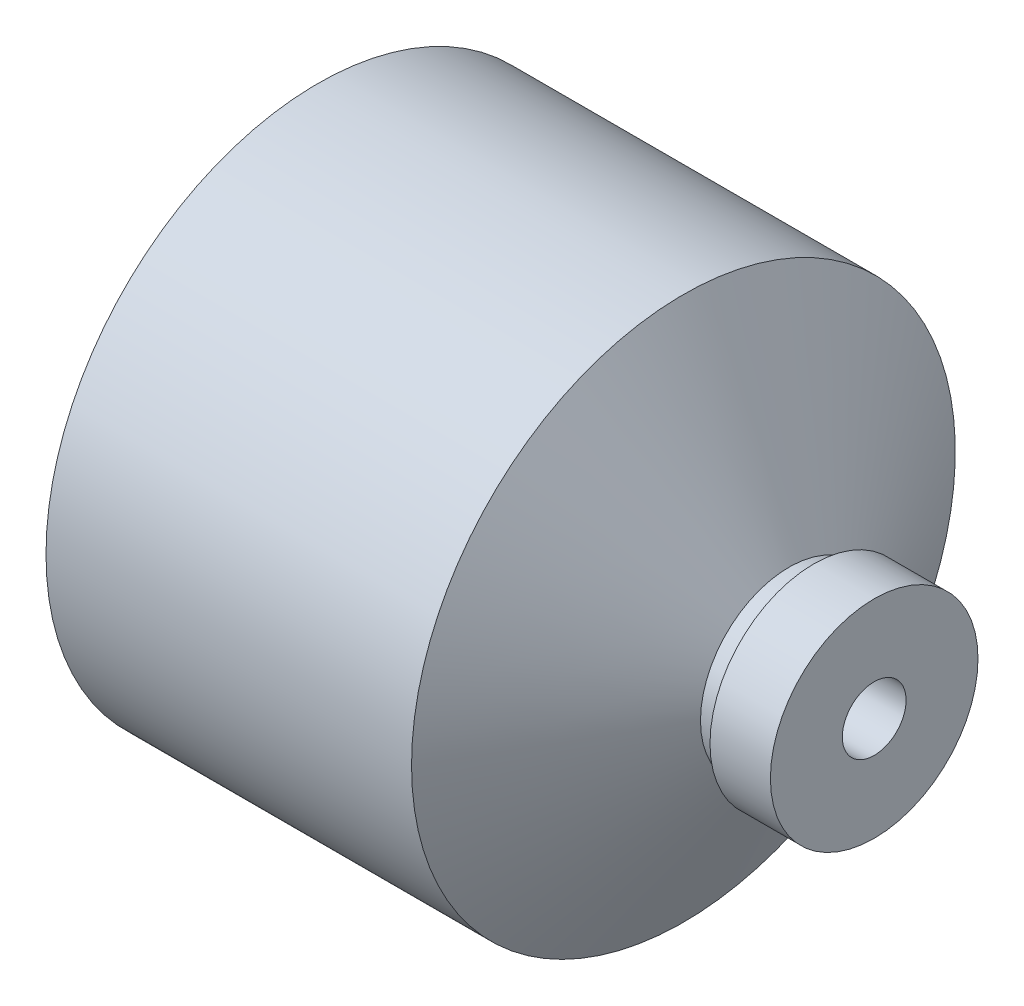
ISO-10303-21;
HEADER;
FILE_DESCRIPTION(('STEP AP214'),'2;1');
FILE_NAME('part.step','',(''),(''),'','','');
FILE_SCHEMA(('AUTOMOTIVE_DESIGN { 1 0 10303 214 1 1 1 1 }'));
ENDSEC;
DATA;
#1=APPLICATION_CONTEXT('core data for automotive mechanical design processes');
#2=APPLICATION_PROTOCOL_DEFINITION('international standard','automotive_design',2000,#1);
#3=PRODUCT_CONTEXT('',#1,'mechanical');
#4=PRODUCT('Part','Part','',(#3));
#5=PRODUCT_RELATED_PRODUCT_CATEGORY('part','',(#4));
#6=PRODUCT_DEFINITION_FORMATION('','',#4);
#7=PRODUCT_DEFINITION_CONTEXT('part definition',#1,'design');
#8=PRODUCT_DEFINITION('design','',#6,#7);
#9=PRODUCT_DEFINITION_SHAPE('','',#8);
#10=(LENGTH_UNIT() NAMED_UNIT(*) SI_UNIT(.MILLI.,.METRE.));
#11=(NAMED_UNIT(*) PLANE_ANGLE_UNIT() SI_UNIT($,.RADIAN.));
#12=(NAMED_UNIT(*) SI_UNIT($,.STERADIAN.) SOLID_ANGLE_UNIT());
#13=UNCERTAINTY_MEASURE_WITH_UNIT(LENGTH_MEASURE(1.E-05),#10,'distance_accuracy_value','');
#14=(GEOMETRIC_REPRESENTATION_CONTEXT(3) GLOBAL_UNCERTAINTY_ASSIGNED_CONTEXT((#13)) GLOBAL_UNIT_ASSIGNED_CONTEXT((#10,
#11,#12)) REPRESENTATION_CONTEXT('',''));
#15=CARTESIAN_POINT('',(0.,0.,0.));
#16=DIRECTION('',(0.,0.,1.));
#17=DIRECTION('',(1.,0.,0.));
#18=AXIS2_PLACEMENT_3D('',#15,#16,#17);
#19=CARTESIAN_POINT('',(-73.6619546181365,0.,-36.));
#20=DIRECTION('',(1.,0.,0.));
#21=DIRECTION('',(0.,0.,-1.));
#22=AXIS2_PLACEMENT_3D('',#19,#20,#21);
#23=PLANE('',#22);
#24=CARTESIAN_POINT('',(-73.6619546181365,0.,0.));
#25=DIRECTION('',(-1.,0.,0.));
#26=DIRECTION('',(0.,0.,1.));
#27=AXIS2_PLACEMENT_3D('',#24,#25,#26);
#28=CIRCLE('',#27,33.75);
#29=CARTESIAN_POINT('',(-73.6619546181365,0.,33.75));
#30=VERTEX_POINT('',#29);
#31=EDGE_CURVE('E10',#30,#30,#28,.T.);
#32=ORIENTED_EDGE('',*,*,#31,.F.);
#33=EDGE_LOOP('',(#32));
#34=FACE_BOUND('',#33,.T.);
#35=CARTESIAN_POINT('',(-73.6619546181365,0.,0.));
#36=DIRECTION('',(-1.,0.,0.));
#37=DIRECTION('',(0.,0.,1.));
#38=AXIS2_PLACEMENT_3D('',#35,#36,#37);
#39=CIRCLE('',#38,36.);
#40=CARTESIAN_POINT('',(-73.6619546181365,0.,36.));
#41=VERTEX_POINT('',#40);
#42=EDGE_CURVE('E88',#41,#41,#39,.T.);
#43=ORIENTED_EDGE('',*,*,#42,.T.);
#44=EDGE_LOOP('',(#43));
#45=FACE_BOUND('',#44,.T.);
#46=ADVANCED_FACE('F39',(#34,#45),#23,.F.);
#47=CARTESIAN_POINT('',(-73.6619546181365,0.,0.));
#48=DIRECTION('',(-1.,0.,0.));
#49=DIRECTION('',(0.,0.,1.));
#50=AXIS2_PLACEMENT_3D('',#47,#48,#49);
#51=CYLINDRICAL_SURFACE('',#50,33.75);
#52=CARTESIAN_POINT('',(-32.6619546181365,0.,0.));
#53=DIRECTION('',(-1.,0.,0.));
#54=DIRECTION('',(0.,0.,1.));
#55=AXIS2_PLACEMENT_3D('',#52,#53,#54);
#56=CIRCLE('',#55,33.75);
#57=CARTESIAN_POINT('',(-32.6619546181365,0.,33.75));
#58=VERTEX_POINT('',#57);
#59=EDGE_CURVE('E45',#58,#58,#56,.T.);
#60=ORIENTED_EDGE('',*,*,#59,.F.);
#61=EDGE_LOOP('',(#60));
#62=FACE_BOUND('',#61,.T.);
#63=ORIENTED_EDGE('',*,*,#31,.T.);
#64=EDGE_LOOP('',(#63));
#65=FACE_BOUND('',#64,.T.);
#66=ADVANCED_FACE('F167',(#62,#65),#51,.F.);
#67=CARTESIAN_POINT('',(-32.6619546181365,0.,0.));
#68=DIRECTION('',(-1.,0.,0.));
#69=DIRECTION('',(0.,0.,1.));
#70=AXIS2_PLACEMENT_3D('',#67,#68,#69);
#71=CONICAL_SURFACE('',#70,33.75,0.78539816339745);
#72=CARTESIAN_POINT('',(-23.6619546181365,0.,0.));
#73=DIRECTION('',(-1.,0.,0.));
#74=DIRECTION('',(0.,0.,1.));
#75=AXIS2_PLACEMENT_3D('',#72,#73,#74);
#76=CIRCLE('',#75,24.75);
#77=CARTESIAN_POINT('',(-23.6619546181365,0.,24.75));
#78=VERTEX_POINT('',#77);
#79=EDGE_CURVE('E49',#78,#78,#76,.T.);
#80=ORIENTED_EDGE('',*,*,#79,.F.);
#81=EDGE_LOOP('',(#80));
#82=FACE_BOUND('',#81,.T.);
#83=ORIENTED_EDGE('',*,*,#59,.T.);
#84=EDGE_LOOP('',(#83));
#85=FACE_BOUND('',#84,.T.);
#86=ADVANCED_FACE('F162',(#82,#85),#71,.F.);
#87=CARTESIAN_POINT('',(-23.6619546181365,0.,-24.75));
#88=DIRECTION('',(1.,0.,0.));
#89=DIRECTION('',(0.,0.,-1.));
#90=AXIS2_PLACEMENT_3D('',#87,#88,#89);
#91=PLANE('',#90);
#92=CARTESIAN_POINT('',(-23.6619546181365,0.,0.));
#93=DIRECTION('',(-1.,0.,0.));
#94=DIRECTION('',(0.,0.,1.));
#95=AXIS2_PLACEMENT_3D('',#92,#93,#94);
#96=CIRCLE('',#95,1.6);
#97=CARTESIAN_POINT('',(-23.6619546181365,0.,1.6));
#98=VERTEX_POINT('',#97);
#99=EDGE_CURVE('E53',#98,#98,#96,.T.);
#100=ORIENTED_EDGE('',*,*,#99,.F.);
#101=EDGE_LOOP('',(#100));
#102=FACE_BOUND('',#101,.T.);
#103=ORIENTED_EDGE('',*,*,#79,.T.);
#104=EDGE_LOOP('',(#103));
#105=FACE_BOUND('',#104,.T.);
#106=ADVANCED_FACE('F156',(#102,#105),#91,.F.);
#107=CARTESIAN_POINT('',(-73.6619546181365,0.,0.));
#108=DIRECTION('',(-1.,0.,0.));
#109=DIRECTION('',(0.,0.,1.));
#110=AXIS2_PLACEMENT_3D('',#107,#108,#109);
#111=CYLINDRICAL_SURFACE('',#110,1.6);
#112=CARTESIAN_POINT('',(-13.6619546181365,0.,0.));
#113=DIRECTION('',(-1.,0.,0.));
#114=DIRECTION('',(0.,0.,1.));
#115=AXIS2_PLACEMENT_3D('',#112,#113,#114);
#116=CIRCLE('',#115,1.6);
#117=CARTESIAN_POINT('',(-13.6619546181365,0.,1.6));
#118=VERTEX_POINT('',#117);
#119=EDGE_CURVE('E58',#118,#118,#116,.T.);
#120=ORIENTED_EDGE('',*,*,#119,.F.);
#121=EDGE_LOOP('',(#120));
#122=FACE_BOUND('',#121,.T.);
#123=ORIENTED_EDGE('',*,*,#99,.T.);
#124=EDGE_LOOP('',(#123));
#125=FACE_BOUND('',#124,.T.);
#126=ADVANCED_FACE('F150',(#122,#125),#111,.F.);
#127=CARTESIAN_POINT('',(-13.6619546181365,0.,-1.6));
#128=DIRECTION('',(1.,0.,0.));
#129=DIRECTION('',(0.,0.,-1.));
#130=AXIS2_PLACEMENT_3D('',#127,#128,#129);
#131=PLANE('',#130);
#132=CARTESIAN_POINT('',(-13.6619546181365,0.,0.));
#133=DIRECTION('',(-1.,0.,0.));
#134=DIRECTION('',(0.,0.,1.));
#135=AXIS2_PLACEMENT_3D('',#132,#133,#134);
#136=CIRCLE('',#135,1.);
#137=CARTESIAN_POINT('',(-13.6619546181365,0.,1.));
#138=VERTEX_POINT('',#137);
#139=EDGE_CURVE('E61',#138,#138,#136,.T.);
#140=ORIENTED_EDGE('',*,*,#139,.F.);
#141=EDGE_LOOP('',(#140));
#142=FACE_BOUND('',#141,.T.);
#143=ORIENTED_EDGE('',*,*,#119,.T.);
#144=EDGE_LOOP('',(#143));
#145=FACE_BOUND('',#144,.T.);
#146=ADVANCED_FACE('F144',(#142,#145),#131,.F.);
#147=CARTESIAN_POINT('',(-73.6619546181365,0.,0.));
#148=DIRECTION('',(-1.,0.,0.));
#149=DIRECTION('',(0.,0.,1.));
#150=AXIS2_PLACEMENT_3D('',#147,#148,#149);
#151=CYLINDRICAL_SURFACE('',#150,1.);
#152=CARTESIAN_POINT('',(-11.6619546181365,0.,0.));
#153=DIRECTION('',(-1.,0.,0.));
#154=DIRECTION('',(0.,0.,1.));
#155=AXIS2_PLACEMENT_3D('',#152,#153,#154);
#156=CIRCLE('',#155,1.);
#157=CARTESIAN_POINT('',(-11.6619546181365,0.,-0.999999999999999));
#158=VERTEX_POINT('',#157);
#159=EDGE_CURVE('E64',#158,#158,#156,.T.);
#160=ORIENTED_EDGE('',*,*,#159,.F.);
#161=EDGE_LOOP('',(#160));
#162=FACE_BOUND('',#161,.T.);
#163=ORIENTED_EDGE('',*,*,#139,.T.);
#164=EDGE_LOOP('',(#163));
#165=FACE_BOUND('',#164,.T.);
#166=ADVANCED_FACE('F138',(#162,#165),#151,.F.);
#167=CARTESIAN_POINT('',(-11.6619546181365,0.,0.));
#168=DIRECTION('',(1.,0.,0.));
#169=DIRECTION('',(0.,0.,-1.));
#170=AXIS2_PLACEMENT_3D('',#167,#168,#169);
#171=CONICAL_SURFACE('',#170,1.,1.0471975511966);
#172=CARTESIAN_POINT('',(-9.8,0.,0.));
#173=DIRECTION('',(-1.,0.,0.));
#174=DIRECTION('',(0.,0.,1.));
#175=AXIS2_PLACEMENT_3D('',#172,#173,#174);
#176=CIRCLE('',#175,4.225);
#177=CARTESIAN_POINT('',(-9.8,0.,-4.225));
#178=VERTEX_POINT('',#177);
#179=EDGE_CURVE('E67',#178,#178,#176,.T.);
#180=CARTESIAN_POINT('',(-9.8,0.,-4.225));
#181=CARTESIAN_POINT('',(-9.81939536060559,0.,-4.19140625));
#182=CARTESIAN_POINT('',(-9.83879072121118,0.,-4.1578125));
#183=CARTESIAN_POINT('',(-9.87758144242236,0.,-4.090625));
#184=CARTESIAN_POINT('',(-9.89697680302795,0.,-4.05703125));
#185=CARTESIAN_POINT('',(-9.93576752423913,0.,-3.98984375));
#186=CARTESIAN_POINT('',(-9.95516288484471,0.,-3.95625));
#187=CARTESIAN_POINT('',(-9.99395360605589,0.,-3.8890625));
#188=CARTESIAN_POINT('',(-10.0133489666615,0.,-3.85546875));
#189=CARTESIAN_POINT('',(-10.0521396878727,0.,-3.78828125));
#190=CARTESIAN_POINT('',(-10.0715350484782,0.,-3.7546875));
#191=CARTESIAN_POINT('',(-10.1103257696894,0.,-3.6875));
#192=CARTESIAN_POINT('',(-10.129721130295,0.,-3.65390625));
#193=CARTESIAN_POINT('',(-10.1685118515062,0.,-3.58671875));
#194=CARTESIAN_POINT('',(-10.1879072121118,0.,-3.553125));
#195=CARTESIAN_POINT('',(-10.226697933323,0.,-3.4859375));
#196=CARTESIAN_POINT('',(-10.2460932939285,0.,-3.45234375));
#197=CARTESIAN_POINT('',(-10.2848840151397,0.,-3.38515625));
#198=CARTESIAN_POINT('',(-10.3042793757453,0.,-3.3515625));
#199=CARTESIAN_POINT('',(-10.3430700969565,0.,-3.284375));
#200=CARTESIAN_POINT('',(-10.3624654575621,0.,-3.25078125));
#201=CARTESIAN_POINT('',(-10.4012561787733,0.,-3.18359375));
#202=CARTESIAN_POINT('',(-10.4206515393788,0.,-3.15));
#203=CARTESIAN_POINT('',(-10.45944226059,0.,-3.0828125));
#204=CARTESIAN_POINT('',(-10.4788376211956,0.,-3.04921875));
#205=CARTESIAN_POINT('',(-10.5176283424068,0.,-2.98203125));
#206=CARTESIAN_POINT('',(-10.5370237030124,0.,-2.9484375));
#207=CARTESIAN_POINT('',(-10.5758144242236,0.,-2.88125));
#208=CARTESIAN_POINT('',(-10.5952097848291,0.,-2.84765625));
#209=CARTESIAN_POINT('',(-10.6340005060403,0.,-2.78046875));
#210=CARTESIAN_POINT('',(-10.6533958666459,0.,-2.746875));
#211=CARTESIAN_POINT('',(-10.6921865878571,0.,-2.6796875));
#212=CARTESIAN_POINT('',(-10.7115819484627,0.,-2.64609375));
#213=CARTESIAN_POINT('',(-10.7503726696738,0.,-2.57890625));
#214=CARTESIAN_POINT('',(-10.7697680302794,0.,-2.5453125));
#215=CARTESIAN_POINT('',(-10.8085587514906,0.,-2.478125));
#216=CARTESIAN_POINT('',(-10.8279541120962,0.,-2.44453125));
#217=CARTESIAN_POINT('',(-10.8667448333074,0.,-2.37734375));
#218=CARTESIAN_POINT('',(-10.886140193913,0.,-2.34375));
#219=CARTESIAN_POINT('',(-10.9249309151241,0.,-2.2765625));
#220=CARTESIAN_POINT('',(-10.9443262757297,0.,-2.24296875));
#221=CARTESIAN_POINT('',(-10.9831169969409,0.,-2.17578125));
#222=CARTESIAN_POINT('',(-11.0025123575465,0.,-2.1421875));
#223=CARTESIAN_POINT('',(-11.0413030787577,0.,-2.075));
#224=CARTESIAN_POINT('',(-11.0606984393633,0.,-2.04140625));
#225=CARTESIAN_POINT('',(-11.0994891605744,0.,-1.97421875));
#226=CARTESIAN_POINT('',(-11.11888452118,0.,-1.940625));
#227=CARTESIAN_POINT('',(-11.1576752423912,0.,-1.8734375));
#228=CARTESIAN_POINT('',(-11.1770706029968,0.,-1.83984375));
#229=CARTESIAN_POINT('',(-11.215861324208,0.,-1.77265625));
#230=CARTESIAN_POINT('',(-11.2352566848136,0.,-1.7390625));
#231=CARTESIAN_POINT('',(-11.2740474060247,0.,-1.671875));
#232=CARTESIAN_POINT('',(-11.2934427666303,0.,-1.63828125));
#233=CARTESIAN_POINT('',(-11.3322334878415,0.,-1.57109375));
#234=CARTESIAN_POINT('',(-11.3516288484471,0.,-1.5375));
#235=CARTESIAN_POINT('',(-11.3904195696583,0.,-1.4703125));
#236=CARTESIAN_POINT('',(-11.4098149302639,0.,-1.43671875));
#237=CARTESIAN_POINT('',(-11.448605651475,0.,-1.36953125));
#238=CARTESIAN_POINT('',(-11.4680010120806,0.,-1.3359375));
#239=CARTESIAN_POINT('',(-11.5067917332918,0.,-1.26875));
#240=CARTESIAN_POINT('',(-11.5261870938974,0.,-1.23515625));
#241=CARTESIAN_POINT('',(-11.5649778151086,0.,-1.16796875));
#242=CARTESIAN_POINT('',(-11.5843731757142,0.,-1.134375));
#243=CARTESIAN_POINT('',(-11.6231638969253,0.,-1.0671875));
#244=CARTESIAN_POINT('',(-11.6425592575309,0.,-1.03359375));
#245=CARTESIAN_POINT('',(-11.6619546181365,0.,-0.999999999999999));
#246=B_SPLINE_CURVE_WITH_KNOTS('',3,(#180,#181,#182,#183,#184,#185,#186,#187,#188,#189,#190,
#191,#192,#193,#194,#195,#196,#197,#198,#199,#200,#201,#202,#203,#204,#205,#206,#207,#208,#209,
#210,#211,#212,#213,#214,#215,#216,#217,#218,#219,#220,#221,#222,#223,#224,#225,#226,#227,#228,
#229,#230,#231,#232,#233,#234,#235,#236,#237,#238,#239,#240,#241,#242,#243,#244,#245),
.UNSPECIFIED.,.F.,.F.,(4,2,2,2,2,2,2,2,2,2,2,2,2,2,2,2,2,2,2,2,2,2,2,2,2,2,2,2,2,2,2,2,4),(0.,
0.116372163633535,0.232744327267068,0.349116490900601,0.465488654534134,0.581860818167668,
0.698232981801202,0.814605145434735,0.930977309068268,1.0473494727018,1.16372163633534,
1.28009379996887,1.3964659636024,1.51283812723594,1.62921029086947,1.745582454503,
1.86195461813654,1.97832678177007,2.0946989454036,2.21107110903714,2.32744327267067,
2.4438154363042,2.56018759993774,2.67655976357127,2.7929319272048,2.90930409083834,
3.02567625447187,3.1420484181054,3.25842058173894,3.37479274537247,3.49116490900601,
3.60753707263954,3.72390923627307),.UNSPECIFIED.);
#247=EDGE_CURVE('BSEAM132',#178,#158,#246,.T.);
#248=ORIENTED_EDGE('',*,*,#179,.F.);
#249=ORIENTED_EDGE('',*,*,#159,.T.);
#250=ORIENTED_EDGE('',*,*,#247,.T.);
#251=ORIENTED_EDGE('',*,*,#247,.F.);
#252=EDGE_LOOP('',(#248,#250,#249,#251));
#253=FACE_BOUND('',#252,.T.);
#254=ADVANCED_FACE('F132',(#253),#171,.F.);
#255=CARTESIAN_POINT('',(-73.6619546181365,0.,0.));
#256=DIRECTION('',(-1.,0.,0.));
#257=DIRECTION('',(0.,0.,1.));
#258=AXIS2_PLACEMENT_3D('',#255,#256,#257);
#259=CYLINDRICAL_SURFACE('',#258,4.225);
#260=CARTESIAN_POINT('',(0.,0.,0.));
#261=DIRECTION('',(-1.,0.,0.));
#262=DIRECTION('',(0.,0.,1.));
#263=AXIS2_PLACEMENT_3D('',#260,#261,#262);
#264=CIRCLE('',#263,4.225);
#265=CARTESIAN_POINT('',(0.,0.,4.225));
#266=VERTEX_POINT('',#265);
#267=EDGE_CURVE('E70',#266,#266,#264,.T.);
#268=ORIENTED_EDGE('',*,*,#267,.F.);
#269=EDGE_LOOP('',(#268));
#270=FACE_BOUND('',#269,.T.);
#271=ORIENTED_EDGE('',*,*,#179,.T.);
#272=EDGE_LOOP('',(#271));
#273=FACE_BOUND('',#272,.T.);
#274=ADVANCED_FACE('F126',(#270,#273),#259,.F.);
#275=CARTESIAN_POINT('',(0.,0.,-13.7436998182677));
#276=DIRECTION('',(-1.,0.,0.));
#277=DIRECTION('',(0.,0.,1.));
#278=AXIS2_PLACEMENT_3D('',#275,#276,#277);
#279=PLANE('',#278);
#280=CARTESIAN_POINT('',(0.,0.,0.));
#281=DIRECTION('',(-1.,0.,0.));
#282=DIRECTION('',(0.,0.,1.));
#283=AXIS2_PLACEMENT_3D('',#280,#281,#282);
#284=CIRCLE('',#283,13.7436998182677);
#285=CARTESIAN_POINT('',(0.,0.,13.7436998182677));
#286=VERTEX_POINT('',#285);
#287=EDGE_CURVE('E73',#286,#286,#284,.T.);
#288=ORIENTED_EDGE('',*,*,#287,.F.);
#289=EDGE_LOOP('',(#288));
#290=FACE_BOUND('',#289,.T.);
#291=ORIENTED_EDGE('',*,*,#267,.T.);
#292=EDGE_LOOP('',(#291));
#293=FACE_BOUND('',#292,.T.);
#294=ADVANCED_FACE('F120',(#290,#293),#279,.F.);
#295=CARTESIAN_POINT('',(-73.6619546181365,0.,0.));
#296=DIRECTION('',(-1.,0.,0.));
#297=DIRECTION('',(0.,0.,1.));
#298=AXIS2_PLACEMENT_3D('',#295,#296,#297);
#299=CYLINDRICAL_SURFACE('',#298,13.7436998182677);
#300=CARTESIAN_POINT('',(-8.00000000000001,0.,0.));
#301=DIRECTION('',(-1.,0.,0.));
#302=DIRECTION('',(0.,0.,1.));
#303=AXIS2_PLACEMENT_3D('',#300,#301,#302);
#304=CIRCLE('',#303,13.7436998182677);
#305=CARTESIAN_POINT('',(-8.00000000000001,0.,13.7436998182677));
#306=VERTEX_POINT('',#305);
#307=EDGE_CURVE('E76',#306,#306,#304,.T.);
#308=ORIENTED_EDGE('',*,*,#307,.F.);
#309=EDGE_LOOP('',(#308));
#310=FACE_BOUND('',#309,.T.);
#311=ORIENTED_EDGE('',*,*,#287,.T.);
#312=EDGE_LOOP('',(#311));
#313=FACE_BOUND('',#312,.T.);
#314=ADVANCED_FACE('F114',(#310,#313),#299,.T.);
#315=CARTESIAN_POINT('',(-8.00000000000001,0.,0.));
#316=DIRECTION('',(1.,0.,0.));
#317=DIRECTION('',(0.,0.,-1.));
#318=AXIS2_PLACEMENT_3D('',#315,#316,#317);
#319=CONICAL_SURFACE('',#318,13.7436998182677,1.0471975511966);
#320=CARTESIAN_POINT('',(-9.15470053837925,0.,0.));
#321=DIRECTION('',(-1.,0.,0.));
#322=DIRECTION('',(0.,0.,1.));
#323=AXIS2_PLACEMENT_3D('',#320,#321,#322);
#324=CIRCLE('',#323,11.7436998182677);
#325=CARTESIAN_POINT('',(-9.15470053837925,0.,11.7436998182677));
#326=VERTEX_POINT('',#325);
#327=EDGE_CURVE('E79',#326,#326,#324,.T.);
#328=ORIENTED_EDGE('',*,*,#327,.F.);
#329=EDGE_LOOP('',(#328));
#330=FACE_BOUND('',#329,.T.);
#331=ORIENTED_EDGE('',*,*,#307,.T.);
#332=EDGE_LOOP('',(#331));
#333=FACE_BOUND('',#332,.T.);
#334=ADVANCED_FACE('F108',(#330,#333),#319,.T.);
#335=CARTESIAN_POINT('',(-73.6619546181365,0.,0.));
#336=DIRECTION('',(-1.,0.,0.));
#337=DIRECTION('',(0.,0.,1.));
#338=AXIS2_PLACEMENT_3D('',#335,#336,#337);
#339=CYLINDRICAL_SURFACE('',#338,11.7436998182677);
#340=CARTESIAN_POINT('',(-11.258048449861,0.,0.));
#341=DIRECTION('',(-1.,0.,0.));
#342=DIRECTION('',(0.,0.,1.));
#343=AXIS2_PLACEMENT_3D('',#340,#341,#342);
#344=CIRCLE('',#343,11.7436998182677);
#345=CARTESIAN_POINT('',(-11.258048449861,0.,11.7436998182677));
#346=VERTEX_POINT('',#345);
#347=EDGE_CURVE('E82',#346,#346,#344,.T.);
#348=ORIENTED_EDGE('',*,*,#347,.F.);
#349=EDGE_LOOP('',(#348));
#350=FACE_BOUND('',#349,.T.);
#351=ORIENTED_EDGE('',*,*,#327,.T.);
#352=EDGE_LOOP('',(#351));
#353=FACE_BOUND('',#352,.T.);
#354=ADVANCED_FACE('F102',(#350,#353),#339,.T.);
#355=CARTESIAN_POINT('',(-11.258048449861,0.,0.));
#356=DIRECTION('',(-1.,0.,0.));
#357=DIRECTION('',(0.,0.,1.));
#358=AXIS2_PLACEMENT_3D('',#355,#356,#357);
#359=CONICAL_SURFACE('',#358,11.7436998182677,1.0471975511966);
#360=CARTESIAN_POINT('',(-25.2624298893283,0.,0.));
#361=DIRECTION('',(-1.,0.,0.));
#362=DIRECTION('',(0.,0.,1.));
#363=AXIS2_PLACEMENT_3D('',#360,#361,#362);
#364=CIRCLE('',#363,36.);
#365=CARTESIAN_POINT('',(-25.2624298893283,0.,36.));
#366=VERTEX_POINT('',#365);
#367=EDGE_CURVE('E85',#366,#366,#364,.T.);
#368=CARTESIAN_POINT('',(-25.2624298893283,0.,36.));
#369=CARTESIAN_POINT('',(-25.1165509160005,0.,35.7473302064403));
#370=CARTESIAN_POINT('',(-24.9706719426728,0.,35.4946604128806));
#371=CARTESIAN_POINT('',(-24.6789139960172,0.,34.9893208257611));
#372=CARTESIAN_POINT('',(-24.5330350226894,0.,34.7366510322014));
#373=CARTESIAN_POINT('',(-24.2412770760338,0.,34.231311445082));
#374=CARTESIAN_POINT('',(-24.0953981027061,0.,33.9786416515223));
#375=CARTESIAN_POINT('',(-23.8036401560505,0.,33.4733020644029));
#376=CARTESIAN_POINT('',(-23.6577611827227,0.,33.2206322708432));
#377=CARTESIAN_POINT('',(-23.3660032360671,0.,32.7152926837237));
#378=CARTESIAN_POINT('',(-23.2201242627394,0.,32.462622890164));
#379=CARTESIAN_POINT('',(-22.9283663160838,0.,31.9572833030446));
#380=CARTESIAN_POINT('',(-22.782487342756,0.,31.7046135094849));
#381=CARTESIAN_POINT('',(-22.4907293961004,0.,31.1992739223655));
#382=CARTESIAN_POINT('',(-22.3448504227726,0.,30.9466041288058));
#383=CARTESIAN_POINT('',(-22.0530924761171,0.,30.4412645416863));
#384=CARTESIAN_POINT('',(-21.9072135027893,0.,30.1885947481266));
#385=CARTESIAN_POINT('',(-21.6154555561337,0.,29.6832551610072));
#386=CARTESIAN_POINT('',(-21.4695765828059,0.,29.4305853674475));
#387=CARTESIAN_POINT('',(-21.1778186361504,0.,28.9252457803281));
#388=CARTESIAN_POINT('',(-21.0319396628226,0.,28.6725759867684));
#389=CARTESIAN_POINT('',(-20.740181716167,0.,28.1672363996489));
#390=CARTESIAN_POINT('',(-20.5943027428392,0.,27.9145666060892));
#391=CARTESIAN_POINT('',(-20.3025447961837,0.,27.4092270189698));
#392=CARTESIAN_POINT('',(-20.1566658228559,0.,27.1565572254101));
#393=CARTESIAN_POINT('',(-19.8649078762003,0.,26.6512176382907));
#394=CARTESIAN_POINT('',(-19.7190289028725,0.,26.3985478447309));
#395=CARTESIAN_POINT('',(-19.4272709562169,0.,25.8932082576115));
#396=CARTESIAN_POINT('',(-19.2813919828892,0.,25.6405384640518));
#397=CARTESIAN_POINT('',(-18.9896340362336,0.,25.1351988769324));
#398=CARTESIAN_POINT('',(-18.8437550629058,0.,24.8825290833727));
#399=CARTESIAN_POINT('',(-18.5519971162502,0.,24.3771894962533));
#400=CARTESIAN_POINT('',(-18.4061181429225,0.,24.1245197026935));
#401=CARTESIAN_POINT('',(-18.1143601962669,0.,23.6191801155741));
#402=CARTESIAN_POINT('',(-17.9684812229391,0.,23.3665103220144));
#403=CARTESIAN_POINT('',(-17.6767232762835,0.,22.861170734895));
#404=CARTESIAN_POINT('',(-17.5308443029557,0.,22.6085009413353));
#405=CARTESIAN_POINT('',(-17.2390863563002,0.,22.1031613542159));
#406=CARTESIAN_POINT('',(-17.0932073829724,0.,21.8504915606561));
#407=CARTESIAN_POINT('',(-16.8014494363168,0.,21.3451519735367));
#408=CARTESIAN_POINT('',(-16.655570462989,0.,21.092482179977));
#409=CARTESIAN_POINT('',(-16.3638125163335,0.,20.5871425928576));
#410=CARTESIAN_POINT('',(-16.2179335430057,0.,20.3344727992979));
#411=CARTESIAN_POINT('',(-15.9261755963501,0.,19.8291332121785));
#412=CARTESIAN_POINT('',(-15.7802966230223,0.,19.5764634186187));
#413=CARTESIAN_POINT('',(-15.4885386763668,0.,19.0711238314993));
#414=CARTESIAN_POINT('',(-15.342659703039,0.,18.8184540379396));
#415=CARTESIAN_POINT('',(-15.0509017563834,0.,18.3131144508202));
#416=CARTESIAN_POINT('',(-14.9050227830556,0.,18.0604446572605));
#417=CARTESIAN_POINT('',(-14.6132648364,0.,17.555105070141));
#418=CARTESIAN_POINT('',(-14.4673858630723,0.,17.3024352765813));
#419=CARTESIAN_POINT('',(-14.1756279164167,0.,16.7970956894619));
#420=CARTESIAN_POINT('',(-14.0297489430889,0.,16.5444258959022));
#421=CARTESIAN_POINT('',(-13.7379909964333,0.,16.0390863087828));
#422=CARTESIAN_POINT('',(-13.5921120231056,0.,15.7864165152231));
#423=CARTESIAN_POINT('',(-13.30035407645,0.,15.2810769281036));
#424=CARTESIAN_POINT('',(-13.1544751031222,0.,15.0284071345439));
#425=CARTESIAN_POINT('',(-12.8627171564666,0.,14.5230675474245));
#426=CARTESIAN_POINT('',(-12.7168381831388,0.,14.2703977538648));
#427=CARTESIAN_POINT('',(-12.4250802364833,0.,13.7650581667454));
#428=CARTESIAN_POINT('',(-12.2792012631555,0.,13.5123883731857));
#429=CARTESIAN_POINT('',(-11.9874433164999,0.,13.0070487860662));
#430=CARTESIAN_POINT('',(-11.8415643431721,0.,12.7543789925065));
#431=CARTESIAN_POINT('',(-11.5498063965166,0.,12.2490394053871));
#432=CARTESIAN_POINT('',(-11.4039274231888,0.,11.9963696118274));
#433=CARTESIAN_POINT('',(-11.258048449861,0.,11.7436998182677));
#434=B_SPLINE_CURVE_WITH_KNOTS('',3,(#368,#369,#370,#371,#372,#373,#374,#375,#376,#377,#378,
#379,#380,#381,#382,#383,#384,#385,#386,#387,#388,#389,#390,#391,#392,#393,#394,#395,#396,#397,
#398,#399,#400,#401,#402,#403,#404,#405,#406,#407,#408,#409,#410,#411,#412,#413,#414,#415,#416,
#417,#418,#419,#420,#421,#422,#423,#424,#425,#426,#427,#428,#429,#430,#431,#432,#433),
.UNSPECIFIED.,.F.,.F.,(4,2,2,2,2,2,2,2,2,2,2,2,2,2,2,2,2,2,2,2,2,2,2,2,2,2,2,2,2,2,2,2,4),(0.,
0.875273839966714,1.75054767993344,2.62582151990015,3.50109535986687,4.37636919983358,
5.25164303980031,6.12691687976702,7.00219071973374,7.87746455970045,8.75273839966717,
9.62801223963389,10.5032860796006,11.3785599195673,12.253833759534,13.1291075995008,
14.0043814394675,14.8796552794342,15.7549291194009,16.6302029593676,17.5054767993343,
18.3807506393011,19.2560244792678,20.1312983192345,21.0065721592012,21.8818459991679,
22.7571198391346,23.6323936791014,24.5076675190681,25.3829413590348,26.2582151990015,
27.1334890389682,28.0087628789349),.UNSPECIFIED.);
#435=EDGE_CURVE('BSEAM96',#366,#346,#434,.T.);
#436=ORIENTED_EDGE('',*,*,#367,.F.);
#437=ORIENTED_EDGE('',*,*,#347,.T.);
#438=ORIENTED_EDGE('',*,*,#435,.T.);
#439=ORIENTED_EDGE('',*,*,#435,.F.);
#440=EDGE_LOOP('',(#436,#438,#437,#439));
#441=FACE_BOUND('',#440,.T.);
#442=ADVANCED_FACE('F96',(#441),#359,.T.);
#443=CARTESIAN_POINT('',(-73.6619546181365,0.,0.));
#444=DIRECTION('',(-1.,0.,0.));
#445=DIRECTION('',(0.,0.,1.));
#446=AXIS2_PLACEMENT_3D('',#443,#444,#445);
#447=CYLINDRICAL_SURFACE('',#446,36.);
#448=ORIENTED_EDGE('',*,*,#42,.F.);
#449=EDGE_LOOP('',(#448));
#450=FACE_BOUND('',#449,.T.);
#451=ORIENTED_EDGE('',*,*,#367,.T.);
#452=EDGE_LOOP('',(#451));
#453=FACE_BOUND('',#452,.T.);
#454=ADVANCED_FACE('F93',(#450,#453),#447,.T.);
#455=CLOSED_SHELL('',(#46,#66,#86,#106,#126,#146,#166,#254,#274,#294,#314,#334,#354,#442,#454));
#456=MANIFOLD_SOLID_BREP('B2',#455);
#457=ADVANCED_BREP_SHAPE_REPRESENTATION('',(#18,#456),#14);
#458=SHAPE_DEFINITION_REPRESENTATION(#9,#457);
ENDSEC;
END-ISO-10303-21;
